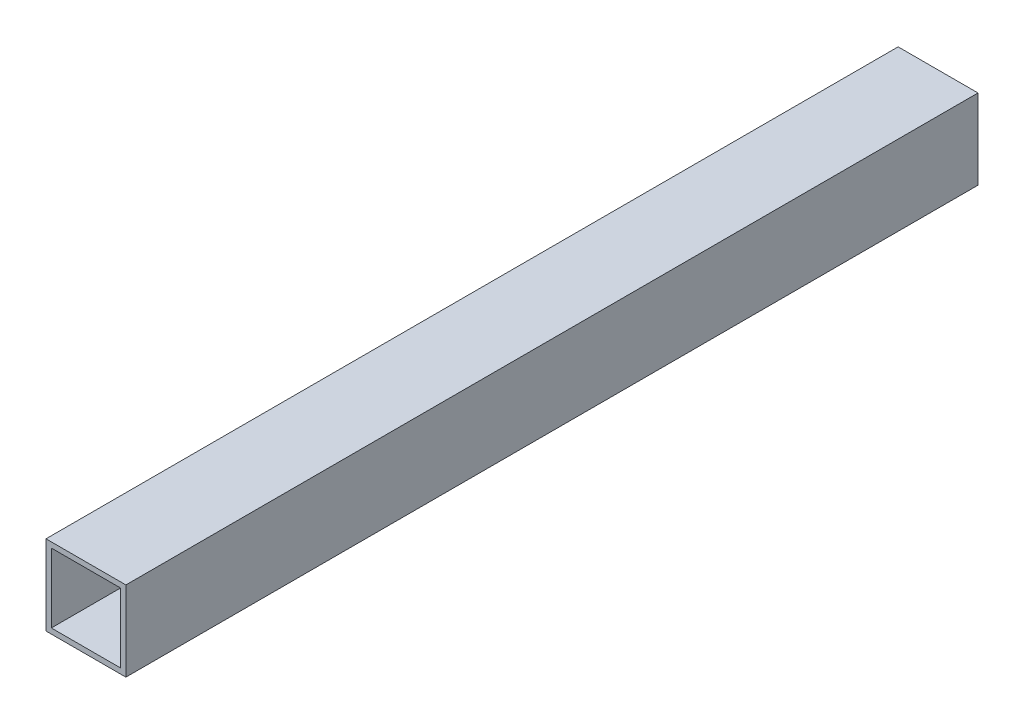
ISO-10303-21;
HEADER;
FILE_DESCRIPTION(('STEP AP214'),'2;1');
FILE_NAME('part.step','',(''),(''),'','','');
FILE_SCHEMA(('AUTOMOTIVE_DESIGN { 1 0 10303 214 1 1 1 1 }'));
ENDSEC;
DATA;
#1=APPLICATION_CONTEXT('core data for automotive mechanical design processes');
#2=APPLICATION_PROTOCOL_DEFINITION('international standard','automotive_design',2000,#1);
#3=PRODUCT_CONTEXT('',#1,'mechanical');
#4=PRODUCT('Part','Part','',(#3));
#5=PRODUCT_RELATED_PRODUCT_CATEGORY('part','',(#4));
#6=PRODUCT_DEFINITION_FORMATION('','',#4);
#7=PRODUCT_DEFINITION_CONTEXT('part definition',#1,'design');
#8=PRODUCT_DEFINITION('design','',#6,#7);
#9=PRODUCT_DEFINITION_SHAPE('','',#8);
#10=(LENGTH_UNIT() NAMED_UNIT(*) SI_UNIT(.MILLI.,.METRE.));
#11=(NAMED_UNIT(*) PLANE_ANGLE_UNIT() SI_UNIT($,.RADIAN.));
#12=(NAMED_UNIT(*) SI_UNIT($,.STERADIAN.) SOLID_ANGLE_UNIT());
#13=UNCERTAINTY_MEASURE_WITH_UNIT(LENGTH_MEASURE(1.E-05),#10,'distance_accuracy_value','');
#14=(GEOMETRIC_REPRESENTATION_CONTEXT(3) GLOBAL_UNCERTAINTY_ASSIGNED_CONTEXT((#13)) GLOBAL_UNIT_ASSIGNED_CONTEXT((#10,
#11,#12)) REPRESENTATION_CONTEXT('',''));
#15=CARTESIAN_POINT('',(0.,0.,0.));
#16=DIRECTION('',(0.,0.,1.));
#17=DIRECTION('',(1.,0.,0.));
#18=AXIS2_PLACEMENT_3D('',#15,#16,#17);
#19=CARTESIAN_POINT('',(0.,0.,160.));
#20=DIRECTION('',(0.,0.,1.));
#21=DIRECTION('',(1.,0.,0.));
#22=AXIS2_PLACEMENT_3D('',#19,#20,#21);
#23=PLANE('',#22);
#24=DIRECTION('',(0.,-1.,0.));
#25=VECTOR('',#24,1.);
#26=CARTESIAN_POINT('',(0.,0.,160.));
#27=LINE('',#26,#25);
#28=CARTESIAN_POINT('',(0.,15.,160.));
#29=VERTEX_POINT('',#28);
#30=CARTESIAN_POINT('',(0.,0.,160.));
#31=VERTEX_POINT('',#30);
#32=EDGE_CURVE('E164',#29,#31,#27,.T.);
#33=ORIENTED_EDGE('',*,*,#32,.T.);
#34=DIRECTION('',(1.,0.,0.));
#35=VECTOR('',#34,1.);
#36=CARTESIAN_POINT('',(0.,0.,160.));
#37=LINE('',#36,#35);
#38=CARTESIAN_POINT('',(15.,0.,160.));
#39=VERTEX_POINT('',#38);
#40=EDGE_CURVE('E167',#31,#39,#37,.T.);
#41=ORIENTED_EDGE('',*,*,#40,.T.);
#42=DIRECTION('',(0.,1.,0.));
#43=VECTOR('',#42,1.);
#44=CARTESIAN_POINT('',(15.,0.,160.));
#45=LINE('',#44,#43);
#46=CARTESIAN_POINT('',(15.,15.,160.));
#47=VERTEX_POINT('',#46);
#48=EDGE_CURVE('E170',#39,#47,#45,.T.);
#49=ORIENTED_EDGE('',*,*,#48,.T.);
#50=DIRECTION('',(-1.,0.,0.));
#51=VECTOR('',#50,1.);
#52=CARTESIAN_POINT('',(0.,15.,160.));
#53=LINE('',#52,#51);
#54=EDGE_CURVE('E172',#47,#29,#53,.T.);
#55=ORIENTED_EDGE('',*,*,#54,.T.);
#56=EDGE_LOOP('',(#33,#41,#49,#55));
#57=FACE_BOUND('',#56,.T.);
#58=DIRECTION('',(1.,0.,0.));
#59=VECTOR('',#58,1.);
#60=CARTESIAN_POINT('',(0.,1.,160.));
#61=LINE('',#60,#59);
#62=CARTESIAN_POINT('',(1.,1.,160.));
#63=VERTEX_POINT('',#62);
#64=CARTESIAN_POINT('',(14.,1.,160.));
#65=VERTEX_POINT('',#64);
#66=EDGE_CURVE('E136',#63,#65,#61,.T.);
#67=ORIENTED_EDGE('',*,*,#66,.F.);
#68=DIRECTION('',(0.,-1.,0.));
#69=VECTOR('',#68,1.);
#70=CARTESIAN_POINT('',(1.,0.,160.));
#71=LINE('',#70,#69);
#72=CARTESIAN_POINT('',(0.999999999999998,14.,160.));
#73=VERTEX_POINT('',#72);
#74=EDGE_CURVE('E128',#73,#63,#71,.T.);
#75=ORIENTED_EDGE('',*,*,#74,.F.);
#76=DIRECTION('',(-1.,0.,0.));
#77=VECTOR('',#76,1.);
#78=CARTESIAN_POINT('',(0.,14.,160.));
#79=LINE('',#78,#77);
#80=CARTESIAN_POINT('',(14.,14.,160.));
#81=VERTEX_POINT('',#80);
#82=EDGE_CURVE('E150',#81,#73,#79,.T.);
#83=ORIENTED_EDGE('',*,*,#82,.F.);
#84=DIRECTION('',(0.,1.,0.));
#85=VECTOR('',#84,1.);
#86=CARTESIAN_POINT('',(14.,0.,160.));
#87=LINE('',#86,#85);
#88=EDGE_CURVE('E148',#65,#81,#87,.T.);
#89=ORIENTED_EDGE('',*,*,#88,.F.);
#90=EDGE_LOOP('',(#67,#75,#83,#89));
#91=FACE_BOUND('',#90,.T.);
#92=ADVANCED_FACE('F63',(#57,#91),#23,.T.);
#93=CARTESIAN_POINT('',(0.,0.,0.));
#94=DIRECTION('',(0.,0.,1.));
#95=DIRECTION('',(1.,0.,0.));
#96=AXIS2_PLACEMENT_3D('',#93,#94,#95);
#97=PLANE('',#96);
#98=DIRECTION('',(0.,-1.,0.));
#99=VECTOR('',#98,1.);
#100=CARTESIAN_POINT('',(0.,0.,0.));
#101=LINE('',#100,#99);
#102=CARTESIAN_POINT('',(0.,15.,0.));
#103=VERTEX_POINT('',#102);
#104=CARTESIAN_POINT('',(0.,0.,0.));
#105=VERTEX_POINT('',#104);
#106=EDGE_CURVE('E144',#103,#105,#101,.T.);
#107=ORIENTED_EDGE('',*,*,#106,.F.);
#108=DIRECTION('',(-1.,0.,0.));
#109=VECTOR('',#108,1.);
#110=CARTESIAN_POINT('',(0.,15.,0.));
#111=LINE('',#110,#109);
#112=CARTESIAN_POINT('',(15.,15.,0.));
#113=VERTEX_POINT('',#112);
#114=EDGE_CURVE('E168',#113,#103,#111,.T.);
#115=ORIENTED_EDGE('',*,*,#114,.F.);
#116=DIRECTION('',(0.,1.,0.));
#117=VECTOR('',#116,1.);
#118=CARTESIAN_POINT('',(15.,0.,0.));
#119=LINE('',#118,#117);
#120=CARTESIAN_POINT('',(15.,0.,0.));
#121=VERTEX_POINT('',#120);
#122=EDGE_CURVE('E179',#121,#113,#119,.T.);
#123=ORIENTED_EDGE('',*,*,#122,.F.);
#124=DIRECTION('',(1.,0.,0.));
#125=VECTOR('',#124,1.);
#126=CARTESIAN_POINT('',(0.,0.,0.));
#127=LINE('',#126,#125);
#128=EDGE_CURVE('E177',#105,#121,#127,.T.);
#129=ORIENTED_EDGE('',*,*,#128,.F.);
#130=EDGE_LOOP('',(#107,#115,#123,#129));
#131=FACE_BOUND('',#130,.T.);
#132=DIRECTION('',(0.,-1.,0.));
#133=VECTOR('',#132,1.);
#134=CARTESIAN_POINT('',(1.,0.,0.));
#135=LINE('',#134,#133);
#136=CARTESIAN_POINT('',(0.999999999999998,14.,0.));
#137=VERTEX_POINT('',#136);
#138=CARTESIAN_POINT('',(1.,1.,0.));
#139=VERTEX_POINT('',#138);
#140=EDGE_CURVE('E86',#137,#139,#135,.T.);
#141=ORIENTED_EDGE('',*,*,#140,.T.);
#142=DIRECTION('',(1.,0.,0.));
#143=VECTOR('',#142,1.);
#144=CARTESIAN_POINT('',(0.,1.,0.));
#145=LINE('',#144,#143);
#146=CARTESIAN_POINT('',(14.,1.,0.));
#147=VERTEX_POINT('',#146);
#148=EDGE_CURVE('E143',#139,#147,#145,.T.);
#149=ORIENTED_EDGE('',*,*,#148,.T.);
#150=DIRECTION('',(0.,1.,0.));
#151=VECTOR('',#150,1.);
#152=CARTESIAN_POINT('',(14.,0.,0.));
#153=LINE('',#152,#151);
#154=CARTESIAN_POINT('',(14.,14.,0.));
#155=VERTEX_POINT('',#154);
#156=EDGE_CURVE('E156',#147,#155,#153,.T.);
#157=ORIENTED_EDGE('',*,*,#156,.T.);
#158=DIRECTION('',(-1.,0.,0.));
#159=VECTOR('',#158,1.);
#160=CARTESIAN_POINT('',(0.,14.,0.));
#161=LINE('',#160,#159);
#162=EDGE_CURVE('E137',#155,#137,#161,.T.);
#163=ORIENTED_EDGE('',*,*,#162,.T.);
#164=EDGE_LOOP('',(#141,#149,#157,#163));
#165=FACE_BOUND('',#164,.T.);
#166=ADVANCED_FACE('F197',(#131,#165),#97,.F.);
#167=CARTESIAN_POINT('',(0.,0.,160.));
#168=DIRECTION('',(1.,0.,0.));
#169=DIRECTION('',(0.,1.,0.));
#170=AXIS2_PLACEMENT_3D('',#167,#168,#169);
#171=PLANE('',#170);
#172=ORIENTED_EDGE('',*,*,#106,.T.);
#173=DIRECTION('',(0.,0.,-1.));
#174=VECTOR('',#173,1.);
#175=CARTESIAN_POINT('',(0.,0.,160.));
#176=LINE('',#175,#174);
#177=EDGE_CURVE('E12',#31,#105,#176,.T.);
#178=ORIENTED_EDGE('',*,*,#177,.F.);
#179=ORIENTED_EDGE('',*,*,#32,.F.);
#180=DIRECTION('',(0.,0.,-1.));
#181=VECTOR('',#180,1.);
#182=CARTESIAN_POINT('',(0.,15.,160.));
#183=LINE('',#182,#181);
#184=EDGE_CURVE('E174',#29,#103,#183,.T.);
#185=ORIENTED_EDGE('',*,*,#184,.T.);
#186=EDGE_LOOP('',(#172,#178,#179,#185));
#187=FACE_BOUND('',#186,.T.);
#188=ADVANCED_FACE('F65',(#187),#171,.F.);
#189=CARTESIAN_POINT('',(0.,0.,160.));
#190=DIRECTION('',(0.,1.,0.));
#191=DIRECTION('',(0.,0.,1.));
#192=AXIS2_PLACEMENT_3D('',#189,#190,#191);
#193=PLANE('',#192);
#194=ORIENTED_EDGE('',*,*,#128,.T.);
#195=DIRECTION('',(0.,0.,-1.));
#196=VECTOR('',#195,1.);
#197=CARTESIAN_POINT('',(15.,0.,160.));
#198=LINE('',#197,#196);
#199=EDGE_CURVE('E71',#39,#121,#198,.T.);
#200=ORIENTED_EDGE('',*,*,#199,.F.);
#201=ORIENTED_EDGE('',*,*,#40,.F.);
#202=ORIENTED_EDGE('',*,*,#177,.T.);
#203=EDGE_LOOP('',(#194,#200,#201,#202));
#204=FACE_BOUND('',#203,.T.);
#205=ADVANCED_FACE('F207',(#204),#193,.F.);
#206=CARTESIAN_POINT('',(15.,0.,160.));
#207=DIRECTION('',(-1.,0.,0.));
#208=DIRECTION('',(0.,-1.,0.));
#209=AXIS2_PLACEMENT_3D('',#206,#207,#208);
#210=PLANE('',#209);
#211=ORIENTED_EDGE('',*,*,#122,.T.);
#212=DIRECTION('',(0.,0.,-1.));
#213=VECTOR('',#212,1.);
#214=CARTESIAN_POINT('',(15.,15.,160.));
#215=LINE('',#214,#213);
#216=EDGE_CURVE('E184',#47,#113,#215,.T.);
#217=ORIENTED_EDGE('',*,*,#216,.F.);
#218=ORIENTED_EDGE('',*,*,#48,.F.);
#219=ORIENTED_EDGE('',*,*,#199,.T.);
#220=EDGE_LOOP('',(#211,#217,#218,#219));
#221=FACE_BOUND('',#220,.T.);
#222=ADVANCED_FACE('F191',(#221),#210,.F.);
#223=CARTESIAN_POINT('',(0.,15.,160.));
#224=DIRECTION('',(0.,-1.,0.));
#225=DIRECTION('',(0.,0.,-1.));
#226=AXIS2_PLACEMENT_3D('',#223,#224,#225);
#227=PLANE('',#226);
#228=ORIENTED_EDGE('',*,*,#114,.T.);
#229=ORIENTED_EDGE('',*,*,#184,.F.);
#230=ORIENTED_EDGE('',*,*,#54,.F.);
#231=ORIENTED_EDGE('',*,*,#216,.T.);
#232=EDGE_LOOP('',(#228,#229,#230,#231));
#233=FACE_BOUND('',#232,.T.);
#234=ADVANCED_FACE('F201',(#233),#227,.F.);
#235=CARTESIAN_POINT('',(1.,0.,160.));
#236=DIRECTION('',(1.,0.,0.));
#237=DIRECTION('',(0.,1.,0.));
#238=AXIS2_PLACEMENT_3D('',#235,#236,#237);
#239=PLANE('',#238);
#240=ORIENTED_EDGE('',*,*,#140,.F.);
#241=DIRECTION('',(0.,0.,-1.));
#242=VECTOR('',#241,1.);
#243=CARTESIAN_POINT('',(0.999999999999998,14.,160.));
#244=LINE('',#243,#242);
#245=EDGE_CURVE('E132',#73,#137,#244,.T.);
#246=ORIENTED_EDGE('',*,*,#245,.F.);
#247=ORIENTED_EDGE('',*,*,#74,.T.);
#248=DIRECTION('',(0.,0.,-1.));
#249=VECTOR('',#248,1.);
#250=CARTESIAN_POINT('',(1.,1.,160.));
#251=LINE('',#250,#249);
#252=EDGE_CURVE('E131',#63,#139,#251,.T.);
#253=ORIENTED_EDGE('',*,*,#252,.T.);
#254=EDGE_LOOP('',(#240,#246,#247,#253));
#255=FACE_BOUND('',#254,.T.);
#256=ADVANCED_FACE('F130',(#255),#239,.T.);
#257=CARTESIAN_POINT('',(0.,1.,160.));
#258=DIRECTION('',(0.,1.,0.));
#259=DIRECTION('',(0.,0.,1.));
#260=AXIS2_PLACEMENT_3D('',#257,#258,#259);
#261=PLANE('',#260);
#262=ORIENTED_EDGE('',*,*,#148,.F.);
#263=ORIENTED_EDGE('',*,*,#252,.F.);
#264=ORIENTED_EDGE('',*,*,#66,.T.);
#265=DIRECTION('',(0.,0.,-1.));
#266=VECTOR('',#265,1.);
#267=CARTESIAN_POINT('',(14.,1.,160.));
#268=LINE('',#267,#266);
#269=EDGE_CURVE('E145',#65,#147,#268,.T.);
#270=ORIENTED_EDGE('',*,*,#269,.T.);
#271=EDGE_LOOP('',(#262,#263,#264,#270));
#272=FACE_BOUND('',#271,.T.);
#273=ADVANCED_FACE('F140',(#272),#261,.T.);
#274=CARTESIAN_POINT('',(14.,0.,160.));
#275=DIRECTION('',(-1.,0.,0.));
#276=DIRECTION('',(0.,-1.,0.));
#277=AXIS2_PLACEMENT_3D('',#274,#275,#276);
#278=PLANE('',#277);
#279=ORIENTED_EDGE('',*,*,#156,.F.);
#280=ORIENTED_EDGE('',*,*,#269,.F.);
#281=ORIENTED_EDGE('',*,*,#88,.T.);
#282=DIRECTION('',(0.,0.,-1.));
#283=VECTOR('',#282,1.);
#284=CARTESIAN_POINT('',(14.,14.,160.));
#285=LINE('',#284,#283);
#286=EDGE_CURVE('E78',#81,#155,#285,.T.);
#287=ORIENTED_EDGE('',*,*,#286,.T.);
#288=EDGE_LOOP('',(#279,#280,#281,#287));
#289=FACE_BOUND('',#288,.T.);
#290=ADVANCED_FACE('F230',(#289),#278,.T.);
#291=CARTESIAN_POINT('',(0.,14.,160.));
#292=DIRECTION('',(0.,-1.,0.));
#293=DIRECTION('',(0.,0.,-1.));
#294=AXIS2_PLACEMENT_3D('',#291,#292,#293);
#295=PLANE('',#294);
#296=ORIENTED_EDGE('',*,*,#162,.F.);
#297=ORIENTED_EDGE('',*,*,#286,.F.);
#298=ORIENTED_EDGE('',*,*,#82,.T.);
#299=ORIENTED_EDGE('',*,*,#245,.T.);
#300=EDGE_LOOP('',(#296,#297,#298,#299));
#301=FACE_BOUND('',#300,.T.);
#302=ADVANCED_FACE('F234',(#301),#295,.T.);
#303=CLOSED_SHELL('',(#92,#166,#188,#205,#222,#234,#256,#273,#290,#302));
#304=MANIFOLD_SOLID_BREP('B2',#303);
#305=ADVANCED_BREP_SHAPE_REPRESENTATION('',(#18,#304),#14);
#306=SHAPE_DEFINITION_REPRESENTATION(#9,#305);
ENDSEC;
END-ISO-10303-21;
